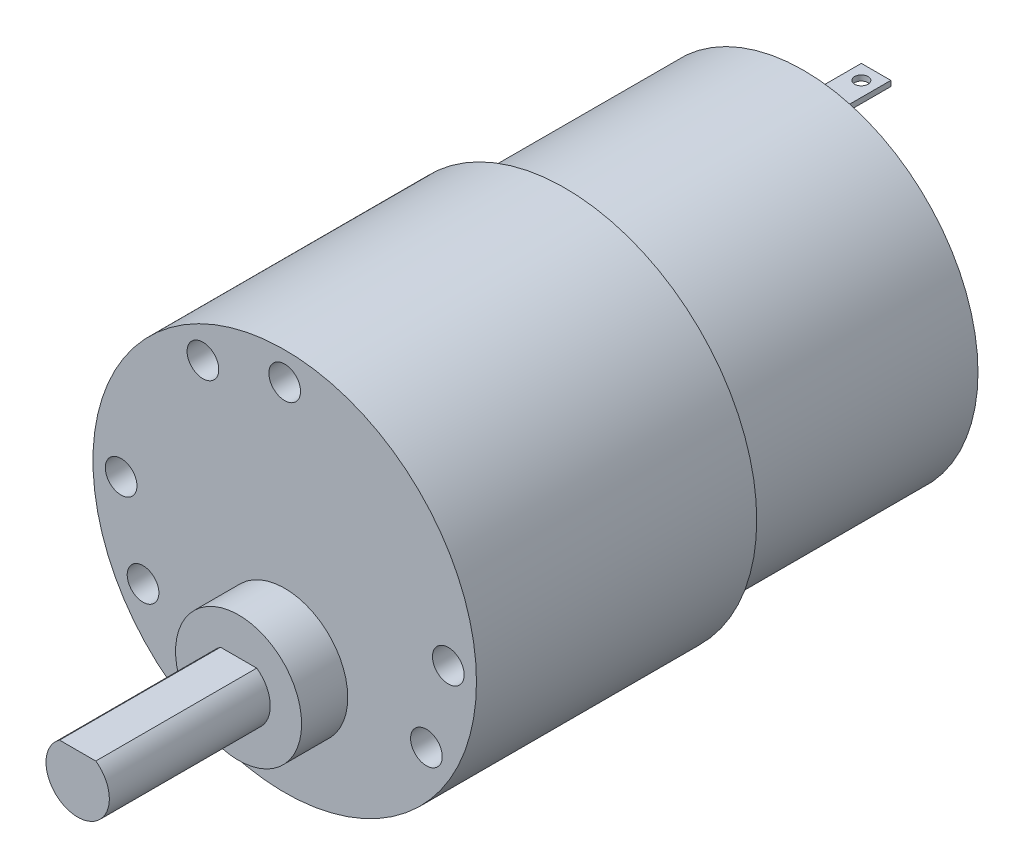
ISO-10303-21;
HEADER;
FILE_DESCRIPTION(('STEP AP214'),'2;1');
FILE_NAME('part.step','',(''),(''),'','','');
FILE_SCHEMA(('AUTOMOTIVE_DESIGN { 1 0 10303 214 1 1 1 1 }'));
ENDSEC;
DATA;
#1=APPLICATION_CONTEXT('core data for automotive mechanical design processes');
#2=APPLICATION_PROTOCOL_DEFINITION('international standard','automotive_design',2000,#1);
#3=PRODUCT_CONTEXT('',#1,'mechanical');
#4=PRODUCT('Part','Part','',(#3));
#5=PRODUCT_RELATED_PRODUCT_CATEGORY('part','',(#4));
#6=PRODUCT_DEFINITION_FORMATION('','',#4);
#7=PRODUCT_DEFINITION_CONTEXT('part definition',#1,'design');
#8=PRODUCT_DEFINITION('design','',#6,#7);
#9=PRODUCT_DEFINITION_SHAPE('','',#8);
#10=(LENGTH_UNIT() NAMED_UNIT(*) SI_UNIT(.MILLI.,.METRE.));
#11=(NAMED_UNIT(*) PLANE_ANGLE_UNIT() SI_UNIT($,.RADIAN.));
#12=(NAMED_UNIT(*) SI_UNIT($,.STERADIAN.) SOLID_ANGLE_UNIT());
#13=UNCERTAINTY_MEASURE_WITH_UNIT(LENGTH_MEASURE(1.E-05),#10,'distance_accuracy_value','');
#14=(GEOMETRIC_REPRESENTATION_CONTEXT(3) GLOBAL_UNCERTAINTY_ASSIGNED_CONTEXT((#13)) GLOBAL_UNIT_ASSIGNED_CONTEXT((#10,
#11,#12)) REPRESENTATION_CONTEXT('',''));
#15=CARTESIAN_POINT('',(0.,0.,0.));
#16=DIRECTION('',(0.,0.,1.));
#17=DIRECTION('',(1.,0.,0.));
#18=AXIS2_PLACEMENT_3D('',#15,#16,#17);
#19=CARTESIAN_POINT('',(0.,-12.7,-23.876));
#20=DIRECTION('',(0.,0.,-1.));
#21=DIRECTION('',(-1.,0.,0.));
#22=AXIS2_PLACEMENT_3D('',#19,#20,#21);
#23=PLANE('',#22);
#24=CARTESIAN_POINT('',(0.,-12.7,-23.876));
#25=DIRECTION('',(0.,0.,-1.));
#26=DIRECTION('',(-1.,0.,0.));
#27=AXIS2_PLACEMENT_3D('',#24,#25,#26);
#28=CIRCLE('',#27,2.413);
#29=CARTESIAN_POINT('',(-2.413,-12.7,-23.876));
#30=VERTEX_POINT('',#29);
#31=EDGE_CURVE('E278',#30,#30,#28,.T.);
#32=ORIENTED_EDGE('',*,*,#31,.T.);
#33=EDGE_LOOP('',(#32));
#34=FACE_BOUND('',#33,.T.);
#35=DIRECTION('',(-1.,0.,0.));
#36=VECTOR('',#35,1.);
#37=CARTESIAN_POINT('',(-1.397,-12.446,-23.876));
#38=LINE('',#37,#36);
#39=CARTESIAN_POINT('',(1.397,-12.446,-23.876));
#40=VERTEX_POINT('',#39);
#41=CARTESIAN_POINT('',(-1.397,-12.446,-23.876));
#42=VERTEX_POINT('',#41);
#43=EDGE_CURVE('E48',#40,#42,#38,.T.);
#44=ORIENTED_EDGE('',*,*,#43,.T.);
#45=DIRECTION('',(0.,1.,0.));
#46=VECTOR('',#45,1.);
#47=CARTESIAN_POINT('',(-1.397,-12.954,-23.876));
#48=LINE('',#47,#46);
#49=CARTESIAN_POINT('',(-1.397,-12.954,-23.876));
#50=VERTEX_POINT('',#49);
#51=EDGE_CURVE('E213',#50,#42,#48,.T.);
#52=ORIENTED_EDGE('',*,*,#51,.F.);
#53=DIRECTION('',(-1.,0.,0.));
#54=VECTOR('',#53,1.);
#55=CARTESIAN_POINT('',(-1.397,-12.954,-23.876));
#56=LINE('',#55,#54);
#57=CARTESIAN_POINT('',(1.397,-12.954,-23.876));
#58=VERTEX_POINT('',#57);
#59=EDGE_CURVE('E188',#58,#50,#56,.T.);
#60=ORIENTED_EDGE('',*,*,#59,.F.);
#61=DIRECTION('',(0.,1.,0.));
#62=VECTOR('',#61,1.);
#63=CARTESIAN_POINT('',(1.397,-12.954,-23.876));
#64=LINE('',#63,#62);
#65=EDGE_CURVE('E198',#58,#40,#64,.T.);
#66=ORIENTED_EDGE('',*,*,#65,.T.);
#67=EDGE_LOOP('',(#44,#52,#60,#66));
#68=FACE_BOUND('',#67,.T.);
#69=ADVANCED_FACE('F33',(#34,#68),#23,.T.);
#70=CARTESIAN_POINT('',(0.,12.7,-23.876));
#71=DIRECTION('',(0.,0.,-1.));
#72=DIRECTION('',(-1.,0.,0.));
#73=AXIS2_PLACEMENT_3D('',#70,#71,#72);
#74=PLANE('',#73);
#75=CARTESIAN_POINT('',(0.,12.7,-23.876));
#76=DIRECTION('',(0.,0.,-1.));
#77=DIRECTION('',(-1.,0.,0.));
#78=AXIS2_PLACEMENT_3D('',#75,#76,#77);
#79=CIRCLE('',#78,2.413);
#80=CARTESIAN_POINT('',(-2.413,12.7,-23.876));
#81=VERTEX_POINT('',#80);
#82=EDGE_CURVE('E272',#81,#81,#79,.T.);
#83=ORIENTED_EDGE('',*,*,#82,.T.);
#84=EDGE_LOOP('',(#83));
#85=FACE_BOUND('',#84,.T.);
#86=DIRECTION('',(1.,0.,0.));
#87=VECTOR('',#86,1.);
#88=CARTESIAN_POINT('',(1.397,12.446,-23.876));
#89=LINE('',#88,#87);
#90=CARTESIAN_POINT('',(-1.397,12.446,-23.876));
#91=VERTEX_POINT('',#90);
#92=CARTESIAN_POINT('',(1.397,12.446,-23.876));
#93=VERTEX_POINT('',#92);
#94=EDGE_CURVE('E56',#91,#93,#89,.T.);
#95=ORIENTED_EDGE('',*,*,#94,.T.);
#96=DIRECTION('',(0.,-1.,0.));
#97=VECTOR('',#96,1.);
#98=CARTESIAN_POINT('',(1.397,12.954,-23.876));
#99=LINE('',#98,#97);
#100=CARTESIAN_POINT('',(1.397,12.954,-23.876));
#101=VERTEX_POINT('',#100);
#102=EDGE_CURVE('E247',#101,#93,#99,.T.);
#103=ORIENTED_EDGE('',*,*,#102,.F.);
#104=DIRECTION('',(1.,0.,0.));
#105=VECTOR('',#104,1.);
#106=CARTESIAN_POINT('',(1.397,12.954,-23.876));
#107=LINE('',#106,#105);
#108=CARTESIAN_POINT('',(-1.397,12.954,-23.876));
#109=VERTEX_POINT('',#108);
#110=EDGE_CURVE('E222',#109,#101,#107,.T.);
#111=ORIENTED_EDGE('',*,*,#110,.F.);
#112=DIRECTION('',(0.,-1.,0.));
#113=VECTOR('',#112,1.);
#114=CARTESIAN_POINT('',(-1.397,12.954,-23.876));
#115=LINE('',#114,#113);
#116=EDGE_CURVE('E232',#109,#91,#115,.T.);
#117=ORIENTED_EDGE('',*,*,#116,.T.);
#118=EDGE_LOOP('',(#95,#103,#111,#117));
#119=FACE_BOUND('',#118,.T.);
#120=ADVANCED_FACE('F321',(#85,#119),#74,.T.);
#121=CARTESIAN_POINT('',(0.,-7.366,30.9118));
#122=DIRECTION('',(0.,0.,1.));
#123=DIRECTION('',(1.,0.,0.));
#124=AXIS2_PLACEMENT_3D('',#121,#122,#123);
#125=PLANE('',#124);
#126=CARTESIAN_POINT('',(0.,-7.366,30.9118));
#127=DIRECTION('',(0.,0.,1.));
#128=DIRECTION('',(1.,0.,0.));
#129=AXIS2_PLACEMENT_3D('',#126,#127,#128);
#130=CIRCLE('',#129,5.969);
#131=CARTESIAN_POINT('',(5.969,-7.366,30.9118));
#132=VERTEX_POINT('',#131);
#133=EDGE_CURVE('E266',#132,#132,#130,.T.);
#134=ORIENTED_EDGE('',*,*,#133,.T.);
#135=EDGE_LOOP('',(#134));
#136=FACE_BOUND('',#135,.T.);
#137=DIRECTION('',(-1.,0.,0.));
#138=VECTOR('',#137,1.);
#139=CARTESIAN_POINT('',(-1.71565701700544,-4.905,30.9118));
#140=LINE('',#139,#138);
#141=CARTESIAN_POINT('',(1.71565701700544,-4.905,30.9118));
#142=VERTEX_POINT('',#141);
#143=CARTESIAN_POINT('',(-1.71565701700544,-4.905,30.9118));
#144=VERTEX_POINT('',#143);
#145=EDGE_CURVE('E255',#142,#144,#140,.T.);
#146=ORIENTED_EDGE('',*,*,#145,.F.);
#147=CARTESIAN_POINT('',(0.,-7.366,30.9118));
#148=DIRECTION('',(0.,0.,1.));
#149=DIRECTION('',(1.,0.,0.));
#150=AXIS2_PLACEMENT_3D('',#147,#148,#149);
#151=CIRCLE('',#150,3.);
#152=EDGE_CURVE('E250',#144,#142,#151,.T.);
#153=ORIENTED_EDGE('',*,*,#152,.F.);
#154=EDGE_LOOP('',(#146,#153));
#155=FACE_BOUND('',#154,.T.);
#156=ADVANCED_FACE('F327',(#136,#155),#125,.T.);
#157=CARTESIAN_POINT('',(0.,0.,26.543));
#158=DIRECTION('',(0.,0.,1.));
#159=DIRECTION('',(1.,0.,0.));
#160=AXIS2_PLACEMENT_3D('',#157,#158,#159);
#161=PLANE('',#160);
#162=CARTESIAN_POINT('',(-7.74699999999983,13.4181976062362,26.543));
#163=DIRECTION('',(0.,0.,1.));
#164=DIRECTION('',(1.,0.,0.));
#165=AXIS2_PLACEMENT_3D('',#162,#163,#164);
#166=CIRCLE('',#165,1.49999999999999);
#167=CARTESIAN_POINT('',(-6.24699999999984,13.4181976062362,26.543));
#168=VERTEX_POINT('',#167);
#169=EDGE_CURVE('E142',#168,#168,#166,.T.);
#170=ORIENTED_EDGE('',*,*,#169,.F.);
#171=EDGE_LOOP('',(#170));
#172=FACE_BOUND('',#171,.T.);
#173=CARTESIAN_POINT('',(-15.494,1.62291035592107E-13,26.543));
#174=DIRECTION('',(0.,0.,1.));
#175=DIRECTION('',(1.,0.,0.));
#176=AXIS2_PLACEMENT_3D('',#173,#174,#175);
#177=CIRCLE('',#176,1.49999999999999);
#178=CARTESIAN_POINT('',(-13.994,1.62291035592107E-13,26.543));
#179=VERTEX_POINT('',#178);
#180=EDGE_CURVE('E141',#179,#179,#177,.T.);
#181=ORIENTED_EDGE('',*,*,#180,.F.);
#182=EDGE_LOOP('',(#181));
#183=FACE_BOUND('',#182,.T.);
#184=CARTESIAN_POINT('',(-13.4181976062362,-7.74699999999987,26.543));
#185=DIRECTION('',(0.,0.,1.));
#186=DIRECTION('',(1.,0.,0.));
#187=AXIS2_PLACEMENT_3D('',#184,#185,#186);
#188=CIRCLE('',#187,1.49999999999999);
#189=CARTESIAN_POINT('',(-11.9181976062362,-7.74699999999987,26.543));
#190=VERTEX_POINT('',#189);
#191=EDGE_CURVE('E152',#190,#190,#188,.T.);
#192=ORIENTED_EDGE('',*,*,#191,.F.);
#193=EDGE_LOOP('',(#192));
#194=FACE_BOUND('',#193,.T.);
#195=CARTESIAN_POINT('',(-7.74700000000011,-13.418197606236,26.543));
#196=DIRECTION('',(0.,0.,1.));
#197=DIRECTION('',(1.,0.,0.));
#198=AXIS2_PLACEMENT_3D('',#195,#196,#197);
#199=CIRCLE('',#198,1.49999999999999);
#200=CARTESIAN_POINT('',(-6.24700000000012,-13.418197606236,26.543));
#201=VERTEX_POINT('',#200);
#202=EDGE_CURVE('E158',#201,#201,#199,.T.);
#203=ORIENTED_EDGE('',*,*,#202,.F.);
#204=EDGE_LOOP('',(#203));
#205=FACE_BOUND('',#204,.T.);
#206=CARTESIAN_POINT('',(13.4181976062361,-7.74700000000006,26.543));
#207=DIRECTION('',(0.,0.,1.));
#208=DIRECTION('',(1.,0.,0.));
#209=AXIS2_PLACEMENT_3D('',#206,#207,#208);
#210=CIRCLE('',#209,1.49999999999999);
#211=CARTESIAN_POINT('',(14.918197606236,-7.74700000000006,26.543));
#212=VERTEX_POINT('',#211);
#213=EDGE_CURVE('E164',#212,#212,#210,.T.);
#214=ORIENTED_EDGE('',*,*,#213,.F.);
#215=EDGE_LOOP('',(#214));
#216=FACE_BOUND('',#215,.T.);
#217=CARTESIAN_POINT('',(15.494,0.,26.543));
#218=DIRECTION('',(0.,0.,1.));
#219=DIRECTION('',(1.,0.,0.));
#220=AXIS2_PLACEMENT_3D('',#217,#218,#219);
#221=CIRCLE('',#220,1.49999999999999);
#222=CARTESIAN_POINT('',(16.994,0.,26.543));
#223=VERTEX_POINT('',#222);
#224=EDGE_CURVE('E170',#223,#223,#221,.T.);
#225=ORIENTED_EDGE('',*,*,#224,.F.);
#226=EDGE_LOOP('',(#225));
#227=FACE_BOUND('',#226,.T.);
#228=CARTESIAN_POINT('',(0.,15.494,26.543));
#229=DIRECTION('',(0.,0.,1.));
#230=DIRECTION('',(1.,0.,0.));
#231=AXIS2_PLACEMENT_3D('',#228,#229,#230);
#232=CIRCLE('',#231,1.49999999999999);
#233=CARTESIAN_POINT('',(1.49999999999999,15.494,26.543));
#234=VERTEX_POINT('',#233);
#235=EDGE_CURVE('E176',#234,#234,#232,.T.);
#236=ORIENTED_EDGE('',*,*,#235,.F.);
#237=EDGE_LOOP('',(#236));
#238=FACE_BOUND('',#237,.T.);
#239=CARTESIAN_POINT('',(0.,0.,26.543));
#240=DIRECTION('',(0.,0.,1.));
#241=DIRECTION('',(1.,0.,0.));
#242=AXIS2_PLACEMENT_3D('',#239,#240,#241);
#243=CIRCLE('',#242,18.161);
#244=CARTESIAN_POINT('',(18.161,0.,26.543));
#245=VERTEX_POINT('',#244);
#246=EDGE_CURVE('E41',#245,#245,#243,.T.);
#247=ORIENTED_EDGE('',*,*,#246,.T.);
#248=EDGE_LOOP('',(#247));
#249=FACE_BOUND('',#248,.T.);
#250=CARTESIAN_POINT('',(0.,-7.366,26.543));
#251=DIRECTION('',(0.,0.,1.));
#252=DIRECTION('',(1.,0.,0.));
#253=AXIS2_PLACEMENT_3D('',#250,#251,#252);
#254=CIRCLE('',#253,5.969);
#255=CARTESIAN_POINT('',(5.969,-7.366,26.543));
#256=VERTEX_POINT('',#255);
#257=EDGE_CURVE('E265',#256,#256,#254,.T.);
#258=ORIENTED_EDGE('',*,*,#257,.F.);
#259=EDGE_LOOP('',(#258));
#260=FACE_BOUND('',#259,.T.);
#261=ADVANCED_FACE('F341',(#172,#183,#194,#205,#216,#227,#238,#249,#260),#161,.T.);
#262=CARTESIAN_POINT('',(0.,0.,-22.606));
#263=DIRECTION('',(0.,0.,-1.));
#264=DIRECTION('',(-1.,0.,0.));
#265=AXIS2_PLACEMENT_3D('',#262,#263,#264);
#266=PLANE('',#265);
#267=CARTESIAN_POINT('',(0.,-12.7,-22.606));
#268=DIRECTION('',(0.,0.,-1.));
#269=DIRECTION('',(-1.,0.,0.));
#270=AXIS2_PLACEMENT_3D('',#267,#268,#269);
#271=CIRCLE('',#270,2.413);
#272=CARTESIAN_POINT('',(-2.413,-12.7,-22.606));
#273=VERTEX_POINT('',#272);
#274=EDGE_CURVE('E275',#273,#273,#271,.T.);
#275=ORIENTED_EDGE('',*,*,#274,.F.);
#276=EDGE_LOOP('',(#275));
#277=FACE_BOUND('',#276,.T.);
#278=CARTESIAN_POINT('',(0.,0.,-22.606));
#279=DIRECTION('',(0.,0.,-1.));
#280=DIRECTION('',(-1.,0.,0.));
#281=AXIS2_PLACEMENT_3D('',#278,#279,#280);
#282=CIRCLE('',#281,16.51);
#283=CARTESIAN_POINT('',(-16.51,0.,-22.606));
#284=VERTEX_POINT('',#283);
#285=EDGE_CURVE('E287',#284,#284,#282,.T.);
#286=ORIENTED_EDGE('',*,*,#285,.T.);
#287=EDGE_LOOP('',(#286));
#288=FACE_BOUND('',#287,.T.);
#289=CARTESIAN_POINT('',(0.,0.,-22.606));
#290=DIRECTION('',(0.,0.,-1.));
#291=DIRECTION('',(-1.,0.,0.));
#292=AXIS2_PLACEMENT_3D('',#289,#290,#291);
#293=CIRCLE('',#292,4.5085);
#294=CARTESIAN_POINT('',(-4.5085,0.,-22.606));
#295=VERTEX_POINT('',#294);
#296=EDGE_CURVE('E281',#295,#295,#293,.T.);
#297=ORIENTED_EDGE('',*,*,#296,.F.);
#298=EDGE_LOOP('',(#297));
#299=FACE_BOUND('',#298,.T.);
#300=CARTESIAN_POINT('',(0.,12.7,-22.606));
#301=DIRECTION('',(0.,0.,-1.));
#302=DIRECTION('',(-1.,0.,0.));
#303=AXIS2_PLACEMENT_3D('',#300,#301,#302);
#304=CIRCLE('',#303,2.413);
#305=CARTESIAN_POINT('',(-2.413,12.7,-22.606));
#306=VERTEX_POINT('',#305);
#307=EDGE_CURVE('E269',#306,#306,#304,.T.);
#308=ORIENTED_EDGE('',*,*,#307,.F.);
#309=EDGE_LOOP('',(#308));
#310=FACE_BOUND('',#309,.T.);
#311=ADVANCED_FACE('F301',(#277,#288,#299,#310),#266,.T.);
#312=CARTESIAN_POINT('',(0.,0.,0.));
#313=DIRECTION('',(0.,0.,1.));
#314=DIRECTION('',(1.,0.,0.));
#315=AXIS2_PLACEMENT_3D('',#312,#313,#314);
#316=PLANE('',#315);
#317=CARTESIAN_POINT('',(0.,0.,0.));
#318=DIRECTION('',(0.,0.,1.));
#319=DIRECTION('',(1.,0.,0.));
#320=AXIS2_PLACEMENT_3D('',#317,#318,#319);
#321=CIRCLE('',#320,18.161);
#322=CARTESIAN_POINT('',(18.161,0.,0.));
#323=VERTEX_POINT('',#322);
#324=EDGE_CURVE('E292',#323,#323,#321,.T.);
#325=ORIENTED_EDGE('',*,*,#324,.F.);
#326=EDGE_LOOP('',(#325));
#327=FACE_BOUND('',#326,.T.);
#328=CARTESIAN_POINT('',(0.,0.,0.));
#329=DIRECTION('',(0.,0.,1.));
#330=DIRECTION('',(1.,0.,0.));
#331=AXIS2_PLACEMENT_3D('',#328,#329,#330);
#332=CIRCLE('',#331,16.51);
#333=CARTESIAN_POINT('',(16.51,0.,0.));
#334=VERTEX_POINT('',#333);
#335=EDGE_CURVE('E11',#334,#334,#332,.F.);
#336=ORIENTED_EDGE('',*,*,#335,.F.);
#337=EDGE_LOOP('',(#336));
#338=FACE_BOUND('',#337,.T.);
#339=ADVANCED_FACE('F298',(#327,#338),#316,.F.);
#340=CARTESIAN_POINT('',(0.,0.,26.543));
#341=DIRECTION('',(0.,0.,-1.));
#342=DIRECTION('',(-1.,0.,0.));
#343=AXIS2_PLACEMENT_3D('',#340,#341,#342);
#344=CYLINDRICAL_SURFACE('',#343,18.161);
#345=ORIENTED_EDGE('',*,*,#246,.F.);
#346=EDGE_LOOP('',(#345));
#347=FACE_BOUND('',#346,.T.);
#348=ORIENTED_EDGE('',*,*,#324,.T.);
#349=EDGE_LOOP('',(#348));
#350=FACE_BOUND('',#349,.T.);
#351=ADVANCED_FACE('F35',(#347,#350),#344,.T.);
#352=CARTESIAN_POINT('',(0.,0.,-22.606));
#353=DIRECTION('',(0.,0.,1.));
#354=DIRECTION('',(1.,0.,0.));
#355=AXIS2_PLACEMENT_3D('',#352,#353,#354);
#356=CYLINDRICAL_SURFACE('',#355,16.51);
#357=ORIENTED_EDGE('',*,*,#285,.F.);
#358=EDGE_LOOP('',(#357));
#359=FACE_BOUND('',#358,.T.);
#360=ORIENTED_EDGE('',*,*,#335,.T.);
#361=EDGE_LOOP('',(#360));
#362=FACE_BOUND('',#361,.T.);
#363=ADVANCED_FACE('F304',(#359,#362),#356,.T.);
#364=CARTESIAN_POINT('',(0.,0.,-25.908));
#365=DIRECTION('',(0.,0.,1.));
#366=DIRECTION('',(1.,0.,0.));
#367=AXIS2_PLACEMENT_3D('',#364,#365,#366);
#368=CYLINDRICAL_SURFACE('',#367,4.5085);
#369=CARTESIAN_POINT('',(0.,0.,-25.908));
#370=DIRECTION('',(0.,0.,-1.));
#371=DIRECTION('',(-1.,0.,0.));
#372=AXIS2_PLACEMENT_3D('',#369,#370,#371);
#373=CIRCLE('',#372,4.5085);
#374=CARTESIAN_POINT('',(-4.5085,0.,-25.908));
#375=VERTEX_POINT('',#374);
#376=EDGE_CURVE('E284',#375,#375,#373,.T.);
#377=ORIENTED_EDGE('',*,*,#376,.F.);
#378=EDGE_LOOP('',(#377));
#379=FACE_BOUND('',#378,.T.);
#380=ORIENTED_EDGE('',*,*,#296,.T.);
#381=EDGE_LOOP('',(#380));
#382=FACE_BOUND('',#381,.T.);
#383=ADVANCED_FACE('F306',(#379,#382),#368,.T.);
#384=CARTESIAN_POINT('',(0.,0.,-25.908));
#385=DIRECTION('',(0.,0.,-1.));
#386=DIRECTION('',(-1.,0.,0.));
#387=AXIS2_PLACEMENT_3D('',#384,#385,#386);
#388=PLANE('',#387);
#389=ORIENTED_EDGE('',*,*,#376,.T.);
#390=EDGE_LOOP('',(#389));
#391=FACE_BOUND('',#390,.T.);
#392=ADVANCED_FACE('F313',(#391),#388,.T.);
#393=CARTESIAN_POINT('',(0.,-12.7,-23.876));
#394=DIRECTION('',(0.,0.,1.));
#395=DIRECTION('',(1.,0.,0.));
#396=AXIS2_PLACEMENT_3D('',#393,#394,#395);
#397=CYLINDRICAL_SURFACE('',#396,2.413);
#398=ORIENTED_EDGE('',*,*,#31,.F.);
#399=EDGE_LOOP('',(#398));
#400=FACE_BOUND('',#399,.T.);
#401=ORIENTED_EDGE('',*,*,#274,.T.);
#402=EDGE_LOOP('',(#401));
#403=FACE_BOUND('',#402,.T.);
#404=ADVANCED_FACE('F334',(#400,#403),#397,.T.);
#405=CARTESIAN_POINT('',(0.,12.7,-23.876));
#406=DIRECTION('',(0.,0.,1.));
#407=DIRECTION('',(1.,0.,0.));
#408=AXIS2_PLACEMENT_3D('',#405,#406,#407);
#409=CYLINDRICAL_SURFACE('',#408,2.413);
#410=ORIENTED_EDGE('',*,*,#82,.F.);
#411=EDGE_LOOP('',(#410));
#412=FACE_BOUND('',#411,.T.);
#413=ORIENTED_EDGE('',*,*,#307,.T.);
#414=EDGE_LOOP('',(#413));
#415=FACE_BOUND('',#414,.T.);
#416=ADVANCED_FACE('F333',(#412,#415),#409,.T.);
#417=CARTESIAN_POINT('',(0.,-7.366,30.9118));
#418=DIRECTION('',(0.,0.,-1.));
#419=DIRECTION('',(-1.,0.,0.));
#420=AXIS2_PLACEMENT_3D('',#417,#418,#419);
#421=CYLINDRICAL_SURFACE('',#420,5.969);
#422=ORIENTED_EDGE('',*,*,#133,.F.);
#423=EDGE_LOOP('',(#422));
#424=FACE_BOUND('',#423,.T.);
#425=ORIENTED_EDGE('',*,*,#257,.T.);
#426=EDGE_LOOP('',(#425));
#427=FACE_BOUND('',#426,.T.);
#428=ADVANCED_FACE('F355',(#424,#427),#421,.T.);
#429=CARTESIAN_POINT('',(0.,-7.366,46.1518));
#430=DIRECTION('',(0.,0.,-1.));
#431=DIRECTION('',(-1.,0.,0.));
#432=AXIS2_PLACEMENT_3D('',#429,#430,#431);
#433=CYLINDRICAL_SURFACE('',#432,3.);
#434=ORIENTED_EDGE('',*,*,#152,.T.);
#435=DIRECTION('',(0.,0.,-1.));
#436=VECTOR('',#435,1.);
#437=CARTESIAN_POINT('',(1.71565701700544,-4.905,46.1518));
#438=LINE('',#437,#436);
#439=CARTESIAN_POINT('',(1.71565701700544,-4.905,46.1518));
#440=VERTEX_POINT('',#439);
#441=EDGE_CURVE('E262',#440,#142,#438,.T.);
#442=ORIENTED_EDGE('',*,*,#441,.F.);
#443=CARTESIAN_POINT('',(0.,-7.366,46.1518));
#444=DIRECTION('',(0.,0.,1.));
#445=DIRECTION('',(1.,0.,0.));
#446=AXIS2_PLACEMENT_3D('',#443,#444,#445);
#447=CIRCLE('',#446,3.);
#448=CARTESIAN_POINT('',(-1.71565701700544,-4.905,46.1518));
#449=VERTEX_POINT('',#448);
#450=EDGE_CURVE('E251',#449,#440,#447,.T.);
#451=ORIENTED_EDGE('',*,*,#450,.F.);
#452=DIRECTION('',(0.,0.,-1.));
#453=VECTOR('',#452,1.);
#454=CARTESIAN_POINT('',(-1.71565701700544,-4.905,46.1518));
#455=LINE('',#454,#453);
#456=EDGE_CURVE('E257',#449,#144,#455,.T.);
#457=ORIENTED_EDGE('',*,*,#456,.T.);
#458=EDGE_LOOP('',(#434,#442,#451,#457));
#459=FACE_BOUND('',#458,.T.);
#460=ADVANCED_FACE('F360',(#459),#433,.T.);
#461=CARTESIAN_POINT('',(-1.71565701700544,-4.905,46.1518));
#462=DIRECTION('',(0.,-1.,0.));
#463=DIRECTION('',(0.,0.,-1.));
#464=AXIS2_PLACEMENT_3D('',#461,#462,#463);
#465=PLANE('',#464);
#466=ORIENTED_EDGE('',*,*,#145,.T.);
#467=ORIENTED_EDGE('',*,*,#456,.F.);
#468=DIRECTION('',(-1.,0.,0.));
#469=VECTOR('',#468,1.);
#470=CARTESIAN_POINT('',(-1.71565701700544,-4.905,46.1518));
#471=LINE('',#470,#469);
#472=EDGE_CURVE('E254',#440,#449,#471,.T.);
#473=ORIENTED_EDGE('',*,*,#472,.F.);
#474=ORIENTED_EDGE('',*,*,#441,.T.);
#475=EDGE_LOOP('',(#466,#467,#473,#474));
#476=FACE_BOUND('',#475,.T.);
#477=ADVANCED_FACE('F408',(#476),#465,.F.);
#478=CARTESIAN_POINT('',(0.,-7.366,46.1518));
#479=DIRECTION('',(0.,0.,1.));
#480=DIRECTION('',(1.,0.,0.));
#481=AXIS2_PLACEMENT_3D('',#478,#479,#480);
#482=PLANE('',#481);
#483=ORIENTED_EDGE('',*,*,#450,.T.);
#484=ORIENTED_EDGE('',*,*,#472,.T.);
#485=EDGE_LOOP('',(#483,#484));
#486=FACE_BOUND('',#485,.T.);
#487=ADVANCED_FACE('F385',(#486),#482,.T.);
#488=CARTESIAN_POINT('',(0.,12.954,0.));
#489=DIRECTION('',(0.,-1.,0.));
#490=DIRECTION('',(0.,0.,-1.));
#491=AXIS2_PLACEMENT_3D('',#488,#489,#490);
#492=PLANE('',#491);
#493=ORIENTED_EDGE('',*,*,#110,.T.);
#494=DIRECTION('',(0.,0.,-1.));
#495=VECTOR('',#494,1.);
#496=CARTESIAN_POINT('',(1.397,12.954,-23.876));
#497=LINE('',#496,#495);
#498=CARTESIAN_POINT('',(1.397,12.954,-29.464));
#499=VERTEX_POINT('',#498);
#500=EDGE_CURVE('E225',#101,#499,#497,.T.);
#501=ORIENTED_EDGE('',*,*,#500,.T.);
#502=DIRECTION('',(-1.,0.,0.));
#503=VECTOR('',#502,1.);
#504=CARTESIAN_POINT('',(1.397,12.954,-29.464));
#505=LINE('',#504,#503);
#506=CARTESIAN_POINT('',(-1.397,12.954,-29.464));
#507=VERTEX_POINT('',#506);
#508=EDGE_CURVE('E228',#499,#507,#505,.T.);
#509=ORIENTED_EDGE('',*,*,#508,.T.);
#510=DIRECTION('',(0.,0.,1.));
#511=VECTOR('',#510,1.);
#512=CARTESIAN_POINT('',(-1.397,12.954,-23.876));
#513=LINE('',#512,#511);
#514=EDGE_CURVE('E230',#507,#109,#513,.T.);
#515=ORIENTED_EDGE('',*,*,#514,.T.);
#516=EDGE_LOOP('',(#493,#501,#509,#515));
#517=FACE_BOUND('',#516,.T.);
#518=CARTESIAN_POINT('',(0.,12.954,-28.067));
#519=DIRECTION('',(0.,1.,0.));
#520=DIRECTION('',(0.,0.,1.));
#521=AXIS2_PLACEMENT_3D('',#518,#519,#520);
#522=CIRCLE('',#521,0.634999999999999);
#523=CARTESIAN_POINT('',(0.,12.954,-27.432));
#524=VERTEX_POINT('',#523);
#525=EDGE_CURVE('E217',#524,#524,#522,.T.);
#526=ORIENTED_EDGE('',*,*,#525,.F.);
#527=EDGE_LOOP('',(#526));
#528=FACE_BOUND('',#527,.T.);
#529=ADVANCED_FACE('F382',(#517,#528),#492,.F.);
#530=CARTESIAN_POINT('',(0.,12.446,0.));
#531=DIRECTION('',(0.,-1.,0.));
#532=DIRECTION('',(0.,0.,-1.));
#533=AXIS2_PLACEMENT_3D('',#530,#531,#532);
#534=PLANE('',#533);
#535=ORIENTED_EDGE('',*,*,#94,.F.);
#536=DIRECTION('',(0.,0.,1.));
#537=VECTOR('',#536,1.);
#538=CARTESIAN_POINT('',(-1.397,12.446,-23.876));
#539=LINE('',#538,#537);
#540=CARTESIAN_POINT('',(-1.397,12.446,-29.464));
#541=VERTEX_POINT('',#540);
#542=EDGE_CURVE('E226',#541,#91,#539,.T.);
#543=ORIENTED_EDGE('',*,*,#542,.F.);
#544=DIRECTION('',(-1.,0.,0.));
#545=VECTOR('',#544,1.);
#546=CARTESIAN_POINT('',(1.397,12.446,-29.464));
#547=LINE('',#546,#545);
#548=CARTESIAN_POINT('',(1.397,12.446,-29.464));
#549=VERTEX_POINT('',#548);
#550=EDGE_CURVE('E236',#549,#541,#547,.T.);
#551=ORIENTED_EDGE('',*,*,#550,.F.);
#552=DIRECTION('',(0.,0.,-1.));
#553=VECTOR('',#552,1.);
#554=CARTESIAN_POINT('',(1.397,12.446,-23.876));
#555=LINE('',#554,#553);
#556=EDGE_CURVE('E234',#93,#549,#555,.T.);
#557=ORIENTED_EDGE('',*,*,#556,.F.);
#558=EDGE_LOOP('',(#535,#543,#551,#557));
#559=FACE_BOUND('',#558,.T.);
#560=CARTESIAN_POINT('',(0.,12.446,-28.067));
#561=DIRECTION('',(0.,1.,0.));
#562=DIRECTION('',(0.,0.,1.));
#563=AXIS2_PLACEMENT_3D('',#560,#561,#562);
#564=CIRCLE('',#563,0.634999999999999);
#565=CARTESIAN_POINT('',(0.,12.446,-27.432));
#566=VERTEX_POINT('',#565);
#567=EDGE_CURVE('E216',#566,#566,#564,.T.);
#568=ORIENTED_EDGE('',*,*,#567,.T.);
#569=EDGE_LOOP('',(#568));
#570=FACE_BOUND('',#569,.T.);
#571=ADVANCED_FACE('F373',(#559,#570),#534,.T.);
#572=CARTESIAN_POINT('',(1.397,12.954,-23.876));
#573=DIRECTION('',(-1.,0.,0.));
#574=DIRECTION('',(0.,0.,1.));
#575=AXIS2_PLACEMENT_3D('',#572,#573,#574);
#576=PLANE('',#575);
#577=ORIENTED_EDGE('',*,*,#556,.T.);
#578=DIRECTION('',(0.,-1.,0.));
#579=VECTOR('',#578,1.);
#580=CARTESIAN_POINT('',(1.397,12.954,-29.464));
#581=LINE('',#580,#579);
#582=EDGE_CURVE('E244',#499,#549,#581,.T.);
#583=ORIENTED_EDGE('',*,*,#582,.F.);
#584=ORIENTED_EDGE('',*,*,#500,.F.);
#585=ORIENTED_EDGE('',*,*,#102,.T.);
#586=EDGE_LOOP('',(#577,#583,#584,#585));
#587=FACE_BOUND('',#586,.T.);
#588=ADVANCED_FACE('F380',(#587),#576,.F.);
#589=CARTESIAN_POINT('',(1.397,12.954,-29.464));
#590=DIRECTION('',(0.,0.,1.));
#591=DIRECTION('',(1.,0.,0.));
#592=AXIS2_PLACEMENT_3D('',#589,#590,#591);
#593=PLANE('',#592);
#594=ORIENTED_EDGE('',*,*,#550,.T.);
#595=DIRECTION('',(0.,-1.,0.));
#596=VECTOR('',#595,1.);
#597=CARTESIAN_POINT('',(-1.397,12.954,-29.464));
#598=LINE('',#597,#596);
#599=EDGE_CURVE('E241',#507,#541,#598,.T.);
#600=ORIENTED_EDGE('',*,*,#599,.F.);
#601=ORIENTED_EDGE('',*,*,#508,.F.);
#602=ORIENTED_EDGE('',*,*,#582,.T.);
#603=EDGE_LOOP('',(#594,#600,#601,#602));
#604=FACE_BOUND('',#603,.T.);
#605=ADVANCED_FACE('F376',(#604),#593,.F.);
#606=CARTESIAN_POINT('',(-1.397,12.954,-23.876));
#607=DIRECTION('',(1.,0.,0.));
#608=DIRECTION('',(0.,0.,-1.));
#609=AXIS2_PLACEMENT_3D('',#606,#607,#608);
#610=PLANE('',#609);
#611=ORIENTED_EDGE('',*,*,#542,.T.);
#612=ORIENTED_EDGE('',*,*,#116,.F.);
#613=ORIENTED_EDGE('',*,*,#514,.F.);
#614=ORIENTED_EDGE('',*,*,#599,.T.);
#615=EDGE_LOOP('',(#611,#612,#613,#614));
#616=FACE_BOUND('',#615,.T.);
#617=ADVANCED_FACE('F370',(#616),#610,.F.);
#618=CARTESIAN_POINT('',(0.,12.954,-28.067));
#619=DIRECTION('',(0.,-1.,0.));
#620=DIRECTION('',(0.,0.,-1.));
#621=AXIS2_PLACEMENT_3D('',#618,#619,#620);
#622=CYLINDRICAL_SURFACE('',#621,0.634999999999999);
#623=ORIENTED_EDGE('',*,*,#525,.T.);
#624=EDGE_LOOP('',(#623));
#625=FACE_BOUND('',#624,.T.);
#626=ORIENTED_EDGE('',*,*,#567,.F.);
#627=EDGE_LOOP('',(#626));
#628=FACE_BOUND('',#627,.T.);
#629=ADVANCED_FACE('F389',(#625,#628),#622,.F.);
#630=CARTESIAN_POINT('',(0.,-12.954,0.));
#631=DIRECTION('',(0.,1.,0.));
#632=DIRECTION('',(0.,0.,-1.));
#633=AXIS2_PLACEMENT_3D('',#630,#631,#632);
#634=PLANE('',#633);
#635=ORIENTED_EDGE('',*,*,#59,.T.);
#636=DIRECTION('',(0.,0.,-1.));
#637=VECTOR('',#636,1.);
#638=CARTESIAN_POINT('',(-1.397,-12.954,-23.876));
#639=LINE('',#638,#637);
#640=CARTESIAN_POINT('',(-1.397,-12.954,-29.464));
#641=VERTEX_POINT('',#640);
#642=EDGE_CURVE('E191',#50,#641,#639,.T.);
#643=ORIENTED_EDGE('',*,*,#642,.T.);
#644=DIRECTION('',(1.,0.,0.));
#645=VECTOR('',#644,1.);
#646=CARTESIAN_POINT('',(-1.397,-12.954,-29.464));
#647=LINE('',#646,#645);
#648=CARTESIAN_POINT('',(1.397,-12.954,-29.464));
#649=VERTEX_POINT('',#648);
#650=EDGE_CURVE('E194',#641,#649,#647,.T.);
#651=ORIENTED_EDGE('',*,*,#650,.T.);
#652=DIRECTION('',(0.,0.,1.));
#653=VECTOR('',#652,1.);
#654=CARTESIAN_POINT('',(1.397,-12.954,-23.876));
#655=LINE('',#654,#653);
#656=EDGE_CURVE('E196',#649,#58,#655,.T.);
#657=ORIENTED_EDGE('',*,*,#656,.T.);
#658=EDGE_LOOP('',(#635,#643,#651,#657));
#659=FACE_BOUND('',#658,.T.);
#660=CARTESIAN_POINT('',(0.,-12.954,-28.067));
#661=DIRECTION('',(0.,-1.,0.));
#662=DIRECTION('',(0.,0.,1.));
#663=AXIS2_PLACEMENT_3D('',#660,#661,#662);
#664=CIRCLE('',#663,0.634999999999999);
#665=CARTESIAN_POINT('',(0.,-12.954,-27.432));
#666=VERTEX_POINT('',#665);
#667=EDGE_CURVE('E183',#666,#666,#664,.T.);
#668=ORIENTED_EDGE('',*,*,#667,.F.);
#669=EDGE_LOOP('',(#668));
#670=FACE_BOUND('',#669,.T.);
#671=ADVANCED_FACE('F392',(#659,#670),#634,.F.);
#672=CARTESIAN_POINT('',(0.,-12.446,0.));
#673=DIRECTION('',(0.,1.,0.));
#674=DIRECTION('',(0.,0.,-1.));
#675=AXIS2_PLACEMENT_3D('',#672,#673,#674);
#676=PLANE('',#675);
#677=ORIENTED_EDGE('',*,*,#43,.F.);
#678=DIRECTION('',(0.,0.,1.));
#679=VECTOR('',#678,1.);
#680=CARTESIAN_POINT('',(1.397,-12.446,-23.876));
#681=LINE('',#680,#679);
#682=CARTESIAN_POINT('',(1.397,-12.446,-29.464));
#683=VERTEX_POINT('',#682);
#684=EDGE_CURVE('E192',#683,#40,#681,.T.);
#685=ORIENTED_EDGE('',*,*,#684,.F.);
#686=DIRECTION('',(1.,0.,0.));
#687=VECTOR('',#686,1.);
#688=CARTESIAN_POINT('',(-1.397,-12.446,-29.464));
#689=LINE('',#688,#687);
#690=CARTESIAN_POINT('',(-1.397,-12.446,-29.464));
#691=VERTEX_POINT('',#690);
#692=EDGE_CURVE('E202',#691,#683,#689,.T.);
#693=ORIENTED_EDGE('',*,*,#692,.F.);
#694=DIRECTION('',(0.,0.,-1.));
#695=VECTOR('',#694,1.);
#696=CARTESIAN_POINT('',(-1.397,-12.446,-23.876));
#697=LINE('',#696,#695);
#698=EDGE_CURVE('E200',#42,#691,#697,.T.);
#699=ORIENTED_EDGE('',*,*,#698,.F.);
#700=EDGE_LOOP('',(#677,#685,#693,#699));
#701=FACE_BOUND('',#700,.T.);
#702=CARTESIAN_POINT('',(0.,-12.446,-28.067));
#703=DIRECTION('',(0.,-1.,0.));
#704=DIRECTION('',(0.,0.,1.));
#705=AXIS2_PLACEMENT_3D('',#702,#703,#704);
#706=CIRCLE('',#705,0.634999999999999);
#707=CARTESIAN_POINT('',(0.,-12.446,-27.432));
#708=VERTEX_POINT('',#707);
#709=EDGE_CURVE('E182',#708,#708,#706,.T.);
#710=ORIENTED_EDGE('',*,*,#709,.T.);
#711=EDGE_LOOP('',(#710));
#712=FACE_BOUND('',#711,.T.);
#713=ADVANCED_FACE('F578',(#701,#712),#676,.T.);
#714=CARTESIAN_POINT('',(-1.397,-12.954,-23.876));
#715=DIRECTION('',(1.,0.,0.));
#716=DIRECTION('',(0.,0.,-1.));
#717=AXIS2_PLACEMENT_3D('',#714,#715,#716);
#718=PLANE('',#717);
#719=ORIENTED_EDGE('',*,*,#698,.T.);
#720=DIRECTION('',(0.,1.,0.));
#721=VECTOR('',#720,1.);
#722=CARTESIAN_POINT('',(-1.397,-12.954,-29.464));
#723=LINE('',#722,#721);
#724=EDGE_CURVE('E210',#641,#691,#723,.T.);
#725=ORIENTED_EDGE('',*,*,#724,.F.);
#726=ORIENTED_EDGE('',*,*,#642,.F.);
#727=ORIENTED_EDGE('',*,*,#51,.T.);
#728=EDGE_LOOP('',(#719,#725,#726,#727));
#729=FACE_BOUND('',#728,.T.);
#730=ADVANCED_FACE('F582',(#729),#718,.F.);
#731=CARTESIAN_POINT('',(-1.397,-12.954,-29.464));
#732=DIRECTION('',(0.,0.,1.));
#733=DIRECTION('',(1.,0.,0.));
#734=AXIS2_PLACEMENT_3D('',#731,#732,#733);
#735=PLANE('',#734);
#736=ORIENTED_EDGE('',*,*,#692,.T.);
#737=DIRECTION('',(0.,1.,0.));
#738=VECTOR('',#737,1.);
#739=CARTESIAN_POINT('',(1.397,-12.954,-29.464));
#740=LINE('',#739,#738);
#741=EDGE_CURVE('E207',#649,#683,#740,.T.);
#742=ORIENTED_EDGE('',*,*,#741,.F.);
#743=ORIENTED_EDGE('',*,*,#650,.F.);
#744=ORIENTED_EDGE('',*,*,#724,.T.);
#745=EDGE_LOOP('',(#736,#742,#743,#744));
#746=FACE_BOUND('',#745,.T.);
#747=ADVANCED_FACE('F585',(#746),#735,.F.);
#748=CARTESIAN_POINT('',(1.397,-12.954,-23.876));
#749=DIRECTION('',(-1.,0.,0.));
#750=DIRECTION('',(0.,0.,1.));
#751=AXIS2_PLACEMENT_3D('',#748,#749,#750);
#752=PLANE('',#751);
#753=ORIENTED_EDGE('',*,*,#684,.T.);
#754=ORIENTED_EDGE('',*,*,#65,.F.);
#755=ORIENTED_EDGE('',*,*,#656,.F.);
#756=ORIENTED_EDGE('',*,*,#741,.T.);
#757=EDGE_LOOP('',(#753,#754,#755,#756));
#758=FACE_BOUND('',#757,.T.);
#759=ADVANCED_FACE('F574',(#758),#752,.F.);
#760=CARTESIAN_POINT('',(0.,-12.954,-28.067));
#761=DIRECTION('',(0.,1.,0.));
#762=DIRECTION('',(0.,0.,1.));
#763=AXIS2_PLACEMENT_3D('',#760,#761,#762);
#764=CYLINDRICAL_SURFACE('',#763,0.634999999999999);
#765=ORIENTED_EDGE('',*,*,#667,.T.);
#766=EDGE_LOOP('',(#765));
#767=FACE_BOUND('',#766,.T.);
#768=ORIENTED_EDGE('',*,*,#709,.F.);
#769=EDGE_LOOP('',(#768));
#770=FACE_BOUND('',#769,.T.);
#771=ADVANCED_FACE('F570',(#767,#770),#764,.F.);
#772=CARTESIAN_POINT('',(0.,15.494,16.383));
#773=DIRECTION('',(0.,0.,1.));
#774=DIRECTION('',(1.,0.,0.));
#775=AXIS2_PLACEMENT_3D('',#772,#773,#774);
#776=CONICAL_SURFACE('',#775,1.49999999999999,1.02974425867665);
#777=CARTESIAN_POINT('',(0.,15.494,15.4817090714587));
#778=VERTEX_POINT('',#777);
#779=VERTEX_LOOP('',#778);
#780=FACE_BOUND('',#779,.T.);
#781=CARTESIAN_POINT('',(0.,15.494,16.383));
#782=DIRECTION('',(0.,0.,1.));
#783=DIRECTION('',(1.,0.,0.));
#784=AXIS2_PLACEMENT_3D('',#781,#782,#783);
#785=CIRCLE('',#784,1.49999999999999);
#786=CARTESIAN_POINT('',(1.49999999999999,15.494,16.383));
#787=VERTEX_POINT('',#786);
#788=EDGE_CURVE('E179',#787,#787,#785,.T.);
#789=ORIENTED_EDGE('',*,*,#788,.T.);
#790=EDGE_LOOP('',(#789));
#791=FACE_BOUND('',#790,.T.);
#792=ADVANCED_FACE('F566',(#780,#791),#776,.F.);
#793=CARTESIAN_POINT('',(0.,15.494,26.543));
#794=DIRECTION('',(0.,0.,1.));
#795=DIRECTION('',(1.,0.,0.));
#796=AXIS2_PLACEMENT_3D('',#793,#794,#795);
#797=CYLINDRICAL_SURFACE('',#796,1.49999999999999);
#798=ORIENTED_EDGE('',*,*,#788,.F.);
#799=EDGE_LOOP('',(#798));
#800=FACE_BOUND('',#799,.T.);
#801=ORIENTED_EDGE('',*,*,#235,.T.);
#802=EDGE_LOOP('',(#801));
#803=FACE_BOUND('',#802,.T.);
#804=ADVANCED_FACE('F446',(#800,#803),#797,.F.);
#805=CARTESIAN_POINT('',(15.494,0.,16.383));
#806=DIRECTION('',(0.,0.,1.));
#807=DIRECTION('',(1.,0.,0.));
#808=AXIS2_PLACEMENT_3D('',#805,#806,#807);
#809=CONICAL_SURFACE('',#808,1.49999999999999,1.02974425867665);
#810=CARTESIAN_POINT('',(15.494,0.,15.4817090714587));
#811=VERTEX_POINT('',#810);
#812=VERTEX_LOOP('',#811);
#813=FACE_BOUND('',#812,.T.);
#814=CARTESIAN_POINT('',(15.494,0.,16.383));
#815=DIRECTION('',(0.,0.,1.));
#816=DIRECTION('',(1.,0.,0.));
#817=AXIS2_PLACEMENT_3D('',#814,#815,#816);
#818=CIRCLE('',#817,1.49999999999999);
#819=CARTESIAN_POINT('',(16.994,0.,16.383));
#820=VERTEX_POINT('',#819);
#821=EDGE_CURVE('E173',#820,#820,#818,.T.);
#822=ORIENTED_EDGE('',*,*,#821,.T.);
#823=EDGE_LOOP('',(#822));
#824=FACE_BOUND('',#823,.T.);
#825=ADVANCED_FACE('F451',(#813,#824),#809,.F.);
#826=CARTESIAN_POINT('',(15.494,0.,26.543));
#827=DIRECTION('',(0.,0.,1.));
#828=DIRECTION('',(1.,0.,0.));
#829=AXIS2_PLACEMENT_3D('',#826,#827,#828);
#830=CYLINDRICAL_SURFACE('',#829,1.49999999999999);
#831=ORIENTED_EDGE('',*,*,#821,.F.);
#832=EDGE_LOOP('',(#831));
#833=FACE_BOUND('',#832,.T.);
#834=ORIENTED_EDGE('',*,*,#224,.T.);
#835=EDGE_LOOP('',(#834));
#836=FACE_BOUND('',#835,.T.);
#837=ADVANCED_FACE('F456',(#833,#836),#830,.F.);
#838=CARTESIAN_POINT('',(13.4181976062361,-7.74700000000006,16.383));
#839=DIRECTION('',(0.,0.,1.));
#840=DIRECTION('',(1.,0.,0.));
#841=AXIS2_PLACEMENT_3D('',#838,#839,#840);
#842=CONICAL_SURFACE('',#841,1.49999999999999,1.02974425867665);
#843=CARTESIAN_POINT('',(13.4181976062361,-7.74700000000006,15.4817090714587));
#844=VERTEX_POINT('',#843);
#845=VERTEX_LOOP('',#844);
#846=FACE_BOUND('',#845,.T.);
#847=CARTESIAN_POINT('',(13.4181976062361,-7.74700000000006,16.383));
#848=DIRECTION('',(0.,0.,1.));
#849=DIRECTION('',(1.,0.,0.));
#850=AXIS2_PLACEMENT_3D('',#847,#848,#849);
#851=CIRCLE('',#850,1.49999999999999);
#852=CARTESIAN_POINT('',(14.918197606236,-7.74700000000006,16.383));
#853=VERTEX_POINT('',#852);
#854=EDGE_CURVE('E167',#853,#853,#851,.T.);
#855=ORIENTED_EDGE('',*,*,#854,.T.);
#856=EDGE_LOOP('',(#855));
#857=FACE_BOUND('',#856,.T.);
#858=ADVANCED_FACE('F466',(#846,#857),#842,.F.);
#859=CARTESIAN_POINT('',(13.4181976062361,-7.74700000000006,26.543));
#860=DIRECTION('',(0.,0.,1.));
#861=DIRECTION('',(1.,0.,0.));
#862=AXIS2_PLACEMENT_3D('',#859,#860,#861);
#863=CYLINDRICAL_SURFACE('',#862,1.49999999999999);
#864=ORIENTED_EDGE('',*,*,#854,.F.);
#865=EDGE_LOOP('',(#864));
#866=FACE_BOUND('',#865,.T.);
#867=ORIENTED_EDGE('',*,*,#213,.T.);
#868=EDGE_LOOP('',(#867));
#869=FACE_BOUND('',#868,.T.);
#870=ADVANCED_FACE('F476',(#866,#869),#863,.F.);
#871=CARTESIAN_POINT('',(-7.74700000000011,-13.418197606236,16.383));
#872=DIRECTION('',(0.,0.,1.));
#873=DIRECTION('',(1.,0.,0.));
#874=AXIS2_PLACEMENT_3D('',#871,#872,#873);
#875=CONICAL_SURFACE('',#874,1.49999999999999,1.02974425867665);
#876=CARTESIAN_POINT('',(-7.74700000000011,-13.418197606236,15.4817090714587));
#877=VERTEX_POINT('',#876);
#878=VERTEX_LOOP('',#877);
#879=FACE_BOUND('',#878,.T.);
#880=CARTESIAN_POINT('',(-7.74700000000011,-13.418197606236,16.383));
#881=DIRECTION('',(0.,0.,1.));
#882=DIRECTION('',(1.,0.,0.));
#883=AXIS2_PLACEMENT_3D('',#880,#881,#882);
#884=CIRCLE('',#883,1.49999999999999);
#885=CARTESIAN_POINT('',(-6.24700000000012,-13.418197606236,16.383));
#886=VERTEX_POINT('',#885);
#887=EDGE_CURVE('E161',#886,#886,#884,.T.);
#888=ORIENTED_EDGE('',*,*,#887,.T.);
#889=EDGE_LOOP('',(#888));
#890=FACE_BOUND('',#889,.T.);
#891=ADVANCED_FACE('F486',(#879,#890),#875,.F.);
#892=CARTESIAN_POINT('',(-7.74700000000011,-13.418197606236,26.543));
#893=DIRECTION('',(0.,0.,1.));
#894=DIRECTION('',(1.,0.,0.));
#895=AXIS2_PLACEMENT_3D('',#892,#893,#894);
#896=CYLINDRICAL_SURFACE('',#895,1.49999999999999);
#897=ORIENTED_EDGE('',*,*,#887,.F.);
#898=EDGE_LOOP('',(#897));
#899=FACE_BOUND('',#898,.T.);
#900=ORIENTED_EDGE('',*,*,#202,.T.);
#901=EDGE_LOOP('',(#900));
#902=FACE_BOUND('',#901,.T.);
#903=ADVANCED_FACE('F496',(#899,#902),#896,.F.);
#904=CARTESIAN_POINT('',(-13.4181976062362,-7.74699999999987,16.383));
#905=DIRECTION('',(0.,0.,1.));
#906=DIRECTION('',(1.,0.,0.));
#907=AXIS2_PLACEMENT_3D('',#904,#905,#906);
#908=CONICAL_SURFACE('',#907,1.49999999999999,1.02974425867665);
#909=CARTESIAN_POINT('',(-13.4181976062362,-7.74699999999987,15.4817090714587));
#910=VERTEX_POINT('',#909);
#911=VERTEX_LOOP('',#910);
#912=FACE_BOUND('',#911,.T.);
#913=CARTESIAN_POINT('',(-13.4181976062362,-7.74699999999987,16.383));
#914=DIRECTION('',(0.,0.,1.));
#915=DIRECTION('',(1.,0.,0.));
#916=AXIS2_PLACEMENT_3D('',#913,#914,#915);
#917=CIRCLE('',#916,1.49999999999999);
#918=CARTESIAN_POINT('',(-11.9181976062362,-7.74699999999987,16.383));
#919=VERTEX_POINT('',#918);
#920=EDGE_CURVE('E155',#919,#919,#917,.T.);
#921=ORIENTED_EDGE('',*,*,#920,.T.);
#922=EDGE_LOOP('',(#921));
#923=FACE_BOUND('',#922,.T.);
#924=ADVANCED_FACE('F506',(#912,#923),#908,.F.);
#925=CARTESIAN_POINT('',(-13.4181976062362,-7.74699999999987,26.543));
#926=DIRECTION('',(0.,0.,1.));
#927=DIRECTION('',(1.,0.,0.));
#928=AXIS2_PLACEMENT_3D('',#925,#926,#927);
#929=CYLINDRICAL_SURFACE('',#928,1.49999999999999);
#930=ORIENTED_EDGE('',*,*,#920,.F.);
#931=EDGE_LOOP('',(#930));
#932=FACE_BOUND('',#931,.T.);
#933=ORIENTED_EDGE('',*,*,#191,.T.);
#934=EDGE_LOOP('',(#933));
#935=FACE_BOUND('',#934,.T.);
#936=ADVANCED_FACE('F516',(#932,#935),#929,.F.);
#937=CARTESIAN_POINT('',(-15.494,1.62291035592107E-13,16.383));
#938=DIRECTION('',(0.,0.,1.));
#939=DIRECTION('',(1.,0.,0.));
#940=AXIS2_PLACEMENT_3D('',#937,#938,#939);
#941=CONICAL_SURFACE('',#940,1.49999999999999,1.02974425867665);
#942=CARTESIAN_POINT('',(-15.494,1.62291035592107E-13,15.4817090714587));
#943=VERTEX_POINT('',#942);
#944=VERTEX_LOOP('',#943);
#945=FACE_BOUND('',#944,.T.);
#946=CARTESIAN_POINT('',(-15.494,1.62291035592107E-13,16.383));
#947=DIRECTION('',(0.,0.,1.));
#948=DIRECTION('',(1.,0.,0.));
#949=AXIS2_PLACEMENT_3D('',#946,#947,#948);
#950=CIRCLE('',#949,1.49999999999999);
#951=CARTESIAN_POINT('',(-13.994,1.62291035592107E-13,16.383));
#952=VERTEX_POINT('',#951);
#953=EDGE_CURVE('E145',#952,#952,#950,.T.);
#954=ORIENTED_EDGE('',*,*,#953,.T.);
#955=EDGE_LOOP('',(#954));
#956=FACE_BOUND('',#955,.T.);
#957=ADVANCED_FACE('F526',(#945,#956),#941,.F.);
#958=CARTESIAN_POINT('',(-15.494,1.62291035592107E-13,26.543));
#959=DIRECTION('',(0.,0.,1.));
#960=DIRECTION('',(1.,0.,0.));
#961=AXIS2_PLACEMENT_3D('',#958,#959,#960);
#962=CYLINDRICAL_SURFACE('',#961,1.49999999999999);
#963=ORIENTED_EDGE('',*,*,#953,.F.);
#964=EDGE_LOOP('',(#963));
#965=FACE_BOUND('',#964,.T.);
#966=ORIENTED_EDGE('',*,*,#180,.T.);
#967=EDGE_LOOP('',(#966));
#968=FACE_BOUND('',#967,.T.);
#969=ADVANCED_FACE('F135',(#965,#968),#962,.F.);
#970=CARTESIAN_POINT('',(-7.74699999999983,13.4181976062362,16.383));
#971=DIRECTION('',(0.,0.,1.));
#972=DIRECTION('',(1.,0.,0.));
#973=AXIS2_PLACEMENT_3D('',#970,#971,#972);
#974=CONICAL_SURFACE('',#973,1.49999999999999,1.02974425867665);
#975=CARTESIAN_POINT('',(-7.74699999999983,13.4181976062362,15.4817090714587));
#976=VERTEX_POINT('',#975);
#977=VERTEX_LOOP('',#976);
#978=FACE_BOUND('',#977,.T.);
#979=CARTESIAN_POINT('',(-7.74699999999983,13.4181976062362,16.383));
#980=DIRECTION('',(0.,0.,1.));
#981=DIRECTION('',(1.,0.,0.));
#982=AXIS2_PLACEMENT_3D('',#979,#980,#981);
#983=CIRCLE('',#982,1.49999999999999);
#984=CARTESIAN_POINT('',(-6.24699999999984,13.4181976062362,16.383));
#985=VERTEX_POINT('',#984);
#986=EDGE_CURVE('E139',#985,#985,#983,.T.);
#987=ORIENTED_EDGE('',*,*,#986,.T.);
#988=EDGE_LOOP('',(#987));
#989=FACE_BOUND('',#988,.T.);
#990=ADVANCED_FACE('F131',(#978,#989),#974,.F.);
#991=CARTESIAN_POINT('',(-7.74699999999983,13.4181976062362,26.543));
#992=DIRECTION('',(0.,0.,1.));
#993=DIRECTION('',(1.,0.,0.));
#994=AXIS2_PLACEMENT_3D('',#991,#992,#993);
#995=CYLINDRICAL_SURFACE('',#994,1.49999999999999);
#996=ORIENTED_EDGE('',*,*,#986,.F.);
#997=EDGE_LOOP('',(#996));
#998=FACE_BOUND('',#997,.T.);
#999=ORIENTED_EDGE('',*,*,#169,.T.);
#1000=EDGE_LOOP('',(#999));
#1001=FACE_BOUND('',#1000,.T.);
#1002=ADVANCED_FACE('F134',(#998,#1001),#995,.F.);
#1003=CLOSED_SHELL('',(#69,#120,#156,#261,#311,#339,#351,#363,#383,#392,#404,#416,#428,#460,
#477,#487,#529,#571,#588,#605,#617,#629,#671,#713,#730,#747,#759,#771,#792,#804,#825,#837,#858,
#870,#891,#903,#924,#936,#957,#969,#990,#1002));
#1004=MANIFOLD_SOLID_BREP('B2',#1003);
#1005=ADVANCED_BREP_SHAPE_REPRESENTATION('',(#18,#1004),#14);
#1006=SHAPE_DEFINITION_REPRESENTATION(#9,#1005);
ENDSEC;
END-ISO-10303-21;
